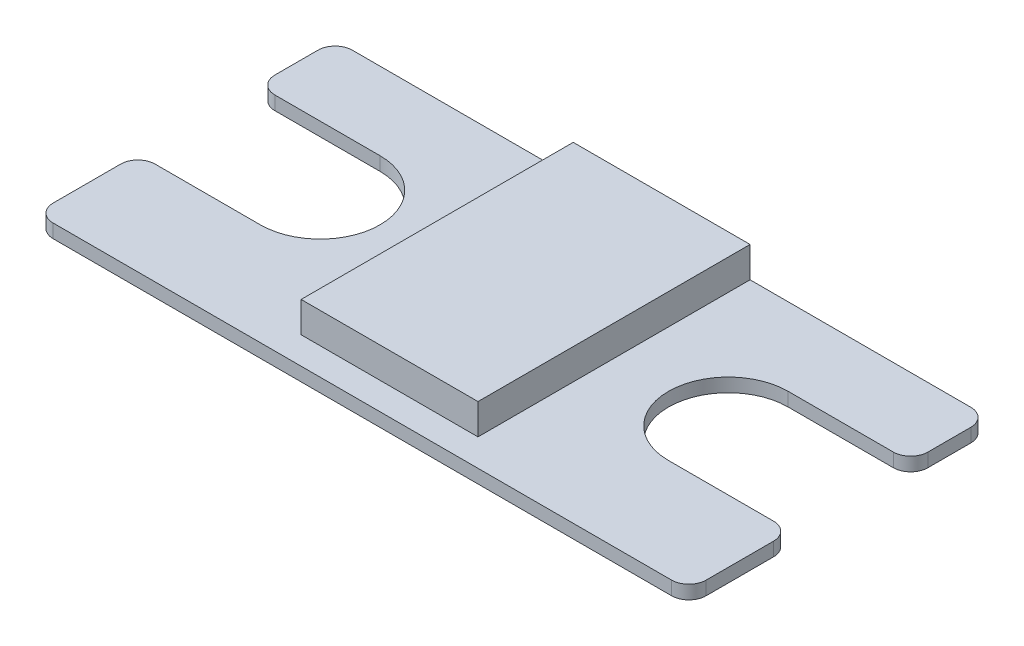
ISO-10303-21;
HEADER;
FILE_DESCRIPTION(('STEP AP214'),'2;1');
FILE_NAME('part.step','',(''),(''),'','','');
FILE_SCHEMA(('AUTOMOTIVE_DESIGN { 1 0 10303 214 1 1 1 1 }'));
ENDSEC;
DATA;
#1=APPLICATION_CONTEXT('core data for automotive mechanical design processes');
#2=APPLICATION_PROTOCOL_DEFINITION('international standard','automotive_design',2000,#1);
#3=PRODUCT_CONTEXT('',#1,'mechanical');
#4=PRODUCT('Part','Part','',(#3));
#5=PRODUCT_RELATED_PRODUCT_CATEGORY('part','',(#4));
#6=PRODUCT_DEFINITION_FORMATION('','',#4);
#7=PRODUCT_DEFINITION_CONTEXT('part definition',#1,'design');
#8=PRODUCT_DEFINITION('design','',#6,#7);
#9=PRODUCT_DEFINITION_SHAPE('','',#8);
#10=(LENGTH_UNIT() NAMED_UNIT(*) SI_UNIT(.MILLI.,.METRE.));
#11=(NAMED_UNIT(*) PLANE_ANGLE_UNIT() SI_UNIT($,.RADIAN.));
#12=(NAMED_UNIT(*) SI_UNIT($,.STERADIAN.) SOLID_ANGLE_UNIT());
#13=UNCERTAINTY_MEASURE_WITH_UNIT(LENGTH_MEASURE(1.E-05),#10,'distance_accuracy_value','');
#14=(GEOMETRIC_REPRESENTATION_CONTEXT(3) GLOBAL_UNCERTAINTY_ASSIGNED_CONTEXT((#13)) GLOBAL_UNIT_ASSIGNED_CONTEXT((#10,
#11,#12)) REPRESENTATION_CONTEXT('',''));
#15=CARTESIAN_POINT('',(0.,0.,0.));
#16=DIRECTION('',(0.,0.,1.));
#17=DIRECTION('',(1.,0.,0.));
#18=AXIS2_PLACEMENT_3D('',#15,#16,#17);
#19=CARTESIAN_POINT('',(9.,1.,-11.9));
#20=DIRECTION('',(0.,-1.,0.));
#21=DIRECTION('',(0.,0.,-1.));
#22=AXIS2_PLACEMENT_3D('',#19,#20,#21);
#23=PLANE('',#22);
#24=DIRECTION('',(0.,0.,1.));
#25=VECTOR('',#24,1.);
#26=CARTESIAN_POINT('',(17.5,1.,-22.));
#27=LINE('',#26,#25);
#28=CARTESIAN_POINT('',(17.5,1.,-22.));
#29=VERTEX_POINT('',#28);
#30=CARTESIAN_POINT('',(17.5,1.,-2.00000000000001));
#31=VERTEX_POINT('',#30);
#32=EDGE_CURVE('E53',#29,#31,#27,.T.);
#33=ORIENTED_EDGE('',*,*,#32,.F.);
#34=DIRECTION('',(-1.,0.,0.));
#35=VECTOR('',#34,1.);
#36=CARTESIAN_POINT('',(0.,1.,-22.));
#37=LINE('',#36,#35);
#38=CARTESIAN_POINT('',(1.27,1.,-22.));
#39=VERTEX_POINT('',#38);
#40=EDGE_CURVE('E239',#29,#39,#37,.T.);
#41=ORIENTED_EDGE('',*,*,#40,.T.);
#42=CARTESIAN_POINT('',(1.27,1.,-20.73));
#43=DIRECTION('',(0.,-1.,0.));
#44=DIRECTION('',(0.,0.,-1.));
#45=AXIS2_PLACEMENT_3D('',#42,#43,#44);
#46=CIRCLE('',#45,1.27);
#47=CARTESIAN_POINT('',(0.,1.,-20.73));
#48=VERTEX_POINT('',#47);
#49=EDGE_CURVE('E326',#39,#48,#46,.F.);
#50=ORIENTED_EDGE('',*,*,#49,.T.);
#51=DIRECTION('',(0.,0.,1.));
#52=VECTOR('',#51,1.);
#53=CARTESIAN_POINT('',(0.,1.,-16.3));
#54=LINE('',#53,#52);
#55=CARTESIAN_POINT('',(0.,1.,-17.57));
#56=VERTEX_POINT('',#55);
#57=EDGE_CURVE('E242',#48,#56,#54,.T.);
#58=ORIENTED_EDGE('',*,*,#57,.T.);
#59=CARTESIAN_POINT('',(1.27,1.,-17.57));
#60=DIRECTION('',(0.,-1.,0.));
#61=DIRECTION('',(0.,0.,-1.));
#62=AXIS2_PLACEMENT_3D('',#59,#60,#61);
#63=CIRCLE('',#62,1.27);
#64=CARTESIAN_POINT('',(1.27,1.,-16.3));
#65=VERTEX_POINT('',#64);
#66=EDGE_CURVE('E324',#56,#65,#63,.F.);
#67=ORIENTED_EDGE('',*,*,#66,.T.);
#68=DIRECTION('',(1.,0.,0.));
#69=VECTOR('',#68,1.);
#70=CARTESIAN_POINT('',(9.,1.,-16.3));
#71=LINE('',#70,#69);
#72=CARTESIAN_POINT('',(9.,1.,-16.3));
#73=VERTEX_POINT('',#72);
#74=EDGE_CURVE('E245',#65,#73,#71,.T.);
#75=ORIENTED_EDGE('',*,*,#74,.T.);
#76=CARTESIAN_POINT('',(9.,1.,-11.9));
#77=DIRECTION('',(0.,-1.,0.));
#78=DIRECTION('',(0.,0.,-1.));
#79=AXIS2_PLACEMENT_3D('',#76,#77,#78);
#80=CIRCLE('',#79,4.39999999999999);
#81=CARTESIAN_POINT('',(9.,1.,-7.5));
#82=VERTEX_POINT('',#81);
#83=EDGE_CURVE('E247',#73,#82,#80,.T.);
#84=ORIENTED_EDGE('',*,*,#83,.T.);
#85=DIRECTION('',(-1.,0.,0.));
#86=VECTOR('',#85,1.);
#87=CARTESIAN_POINT('',(0.,1.,-7.5));
#88=LINE('',#87,#86);
#89=CARTESIAN_POINT('',(1.27,1.,-7.5));
#90=VERTEX_POINT('',#89);
#91=EDGE_CURVE('E249',#82,#90,#88,.T.);
#92=ORIENTED_EDGE('',*,*,#91,.T.);
#93=CARTESIAN_POINT('',(1.27,1.,-6.23));
#94=DIRECTION('',(0.,-1.,0.));
#95=DIRECTION('',(0.,0.,-1.));
#96=AXIS2_PLACEMENT_3D('',#93,#94,#95);
#97=CIRCLE('',#96,1.27);
#98=CARTESIAN_POINT('',(0.,1.,-6.23));
#99=VERTEX_POINT('',#98);
#100=EDGE_CURVE('E322',#90,#99,#97,.F.);
#101=ORIENTED_EDGE('',*,*,#100,.T.);
#102=DIRECTION('',(0.,0.,1.));
#103=VECTOR('',#102,1.);
#104=CARTESIAN_POINT('',(0.,1.,0.));
#105=LINE('',#104,#103);
#106=CARTESIAN_POINT('',(0.,1.,-1.27));
#107=VERTEX_POINT('',#106);
#108=EDGE_CURVE('E252',#99,#107,#105,.T.);
#109=ORIENTED_EDGE('',*,*,#108,.T.);
#110=CARTESIAN_POINT('',(1.27,1.,-1.27));
#111=DIRECTION('',(0.,-1.,0.));
#112=DIRECTION('',(0.,0.,-1.));
#113=AXIS2_PLACEMENT_3D('',#110,#111,#112);
#114=CIRCLE('',#113,1.27);
#115=CARTESIAN_POINT('',(1.27,1.,0.));
#116=VERTEX_POINT('',#115);
#117=EDGE_CURVE('E320',#107,#116,#114,.F.);
#118=ORIENTED_EDGE('',*,*,#117,.T.);
#119=DIRECTION('',(1.,0.,0.));
#120=VECTOR('',#119,1.);
#121=CARTESIAN_POINT('',(48.,1.,0.));
#122=LINE('',#121,#120);
#123=CARTESIAN_POINT('',(46.73,1.,0.));
#124=VERTEX_POINT('',#123);
#125=EDGE_CURVE('E222',#116,#124,#122,.T.);
#126=ORIENTED_EDGE('',*,*,#125,.T.);
#127=CARTESIAN_POINT('',(46.73,1.,-1.26999999999997));
#128=DIRECTION('',(0.,-1.,0.));
#129=DIRECTION('',(0.,0.,-1.));
#130=AXIS2_PLACEMENT_3D('',#127,#128,#129);
#131=CIRCLE('',#130,1.27);
#132=CARTESIAN_POINT('',(48.,1.,-1.26999999999997));
#133=VERTEX_POINT('',#132);
#134=EDGE_CURVE('E334',#124,#133,#131,.F.);
#135=ORIENTED_EDGE('',*,*,#134,.T.);
#136=DIRECTION('',(0.,0.,-1.));
#137=VECTOR('',#136,1.);
#138=CARTESIAN_POINT('',(48.,1.,-7.5));
#139=LINE('',#138,#137);
#140=CARTESIAN_POINT('',(48.,1.,-6.23));
#141=VERTEX_POINT('',#140);
#142=EDGE_CURVE('E225',#133,#141,#139,.T.);
#143=ORIENTED_EDGE('',*,*,#142,.T.);
#144=CARTESIAN_POINT('',(46.73,1.,-6.23));
#145=DIRECTION('',(0.,-1.,0.));
#146=DIRECTION('',(0.,0.,-1.));
#147=AXIS2_PLACEMENT_3D('',#144,#145,#146);
#148=CIRCLE('',#147,1.27);
#149=CARTESIAN_POINT('',(46.73,1.,-7.5));
#150=VERTEX_POINT('',#149);
#151=EDGE_CURVE('E332',#141,#150,#148,.F.);
#152=ORIENTED_EDGE('',*,*,#151,.T.);
#153=DIRECTION('',(-1.,0.,0.));
#154=VECTOR('',#153,1.);
#155=CARTESIAN_POINT('',(39.,1.,-7.5));
#156=LINE('',#155,#154);
#157=CARTESIAN_POINT('',(39.,1.,-7.5));
#158=VERTEX_POINT('',#157);
#159=EDGE_CURVE('E229',#150,#158,#156,.T.);
#160=ORIENTED_EDGE('',*,*,#159,.T.);
#161=CARTESIAN_POINT('',(39.,1.,-11.9));
#162=DIRECTION('',(0.,-1.,0.));
#163=DIRECTION('',(0.,0.,-1.));
#164=AXIS2_PLACEMENT_3D('',#161,#162,#163);
#165=CIRCLE('',#164,4.4);
#166=CARTESIAN_POINT('',(39.,1.,-16.3));
#167=VERTEX_POINT('',#166);
#168=EDGE_CURVE('E231',#158,#167,#165,.T.);
#169=ORIENTED_EDGE('',*,*,#168,.T.);
#170=DIRECTION('',(1.,0.,0.));
#171=VECTOR('',#170,1.);
#172=CARTESIAN_POINT('',(48.,1.,-16.3));
#173=LINE('',#172,#171);
#174=CARTESIAN_POINT('',(46.73,1.,-16.3));
#175=VERTEX_POINT('',#174);
#176=EDGE_CURVE('E233',#167,#175,#173,.T.);
#177=ORIENTED_EDGE('',*,*,#176,.T.);
#178=CARTESIAN_POINT('',(46.73,1.,-17.57));
#179=DIRECTION('',(0.,-1.,0.));
#180=DIRECTION('',(0.,0.,-1.));
#181=AXIS2_PLACEMENT_3D('',#178,#179,#180);
#182=CIRCLE('',#181,1.27);
#183=CARTESIAN_POINT('',(48.,1.,-17.57));
#184=VERTEX_POINT('',#183);
#185=EDGE_CURVE('E330',#175,#184,#182,.F.);
#186=ORIENTED_EDGE('',*,*,#185,.T.);
#187=DIRECTION('',(0.,0.,-1.));
#188=VECTOR('',#187,1.);
#189=CARTESIAN_POINT('',(48.,1.,-22.));
#190=LINE('',#189,#188);
#191=CARTESIAN_POINT('',(48.,1.,-20.73));
#192=VERTEX_POINT('',#191);
#193=EDGE_CURVE('E236',#184,#192,#190,.T.);
#194=ORIENTED_EDGE('',*,*,#193,.T.);
#195=CARTESIAN_POINT('',(46.73,1.,-20.73));
#196=DIRECTION('',(0.,-1.,0.));
#197=DIRECTION('',(0.,0.,-1.));
#198=AXIS2_PLACEMENT_3D('',#195,#196,#197);
#199=CIRCLE('',#198,1.27);
#200=CARTESIAN_POINT('',(46.73,1.,-22.));
#201=VERTEX_POINT('',#200);
#202=EDGE_CURVE('E328',#192,#201,#199,.F.);
#203=ORIENTED_EDGE('',*,*,#202,.T.);
#204=CARTESIAN_POINT('',(30.5,1.,-22.));
#205=VERTEX_POINT('',#204);
#206=EDGE_CURVE('E240',#201,#205,#37,.T.);
#207=ORIENTED_EDGE('',*,*,#206,.T.);
#208=DIRECTION('',(0.,0.,-1.));
#209=VECTOR('',#208,1.);
#210=CARTESIAN_POINT('',(30.5,1.,-22.));
#211=LINE('',#210,#209);
#212=CARTESIAN_POINT('',(30.5,1.,-2.00000000000001));
#213=VERTEX_POINT('',#212);
#214=EDGE_CURVE('E210',#213,#205,#211,.T.);
#215=ORIENTED_EDGE('',*,*,#214,.F.);
#216=DIRECTION('',(1.,0.,0.));
#217=VECTOR('',#216,1.);
#218=CARTESIAN_POINT('',(17.5,1.,-2.00000000000001));
#219=LINE('',#218,#217);
#220=EDGE_CURVE('E48',#31,#213,#219,.T.);
#221=ORIENTED_EDGE('',*,*,#220,.F.);
#222=EDGE_LOOP('',(#33,#41,#50,#58,#67,#75,#84,#92,#101,#109,#118,#126,#135,#143,#152,#160,#169,
#177,#186,#194,#203,#207,#215,#221));
#223=FACE_BOUND('',#222,.T.);
#224=ADVANCED_FACE('F33',(#223),#23,.F.);
#225=CARTESIAN_POINT('',(48.,1.,0.));
#226=DIRECTION('',(0.,0.,-1.));
#227=DIRECTION('',(-1.,0.,0.));
#228=AXIS2_PLACEMENT_3D('',#225,#226,#227);
#229=PLANE('',#228);
#230=DIRECTION('',(1.,0.,0.));
#231=VECTOR('',#230,1.);
#232=CARTESIAN_POINT('',(48.,0.,0.));
#233=LINE('',#232,#231);
#234=CARTESIAN_POINT('',(1.27,0.,0.));
#235=VERTEX_POINT('',#234);
#236=CARTESIAN_POINT('',(46.73,0.,0.));
#237=VERTEX_POINT('',#236);
#238=EDGE_CURVE('E213',#235,#237,#233,.T.);
#239=ORIENTED_EDGE('',*,*,#238,.T.);
#240=DIRECTION('',(0.,-1.,0.));
#241=VECTOR('',#240,1.);
#242=CARTESIAN_POINT('',(46.73,1.,0.));
#243=LINE('',#242,#241);
#244=EDGE_CURVE('E318',#237,#124,#243,.F.);
#245=ORIENTED_EDGE('',*,*,#244,.T.);
#246=ORIENTED_EDGE('',*,*,#125,.F.);
#247=DIRECTION('',(0.,-1.,0.));
#248=VECTOR('',#247,1.);
#249=CARTESIAN_POINT('',(1.27,1.,0.));
#250=LINE('',#249,#248);
#251=EDGE_CURVE('E315',#116,#235,#250,.T.);
#252=ORIENTED_EDGE('',*,*,#251,.T.);
#253=EDGE_LOOP('',(#239,#245,#246,#252));
#254=FACE_BOUND('',#253,.T.);
#255=ADVANCED_FACE('F380',(#254),#229,.F.);
#256=CARTESIAN_POINT('',(48.,1.,-7.5));
#257=DIRECTION('',(-1.,0.,0.));
#258=DIRECTION('',(0.,0.,1.));
#259=AXIS2_PLACEMENT_3D('',#256,#257,#258);
#260=PLANE('',#259);
#261=ORIENTED_EDGE('',*,*,#142,.F.);
#262=DIRECTION('',(0.,-1.,0.));
#263=VECTOR('',#262,1.);
#264=CARTESIAN_POINT('',(48.,1.,-1.26999999999997));
#265=LINE('',#264,#263);
#266=CARTESIAN_POINT('',(48.,0.,-1.26999999999997));
#267=VERTEX_POINT('',#266);
#268=EDGE_CURVE('E296',#133,#267,#265,.T.);
#269=ORIENTED_EDGE('',*,*,#268,.T.);
#270=DIRECTION('',(0.,0.,-1.));
#271=VECTOR('',#270,1.);
#272=CARTESIAN_POINT('',(48.,0.,-7.5));
#273=LINE('',#272,#271);
#274=CARTESIAN_POINT('',(48.,0.,-6.23));
#275=VERTEX_POINT('',#274);
#276=EDGE_CURVE('E216',#267,#275,#273,.T.);
#277=ORIENTED_EDGE('',*,*,#276,.T.);
#278=DIRECTION('',(0.,-1.,0.));
#279=VECTOR('',#278,1.);
#280=CARTESIAN_POINT('',(48.,1.,-6.23));
#281=LINE('',#280,#279);
#282=EDGE_CURVE('E294',#275,#141,#281,.F.);
#283=ORIENTED_EDGE('',*,*,#282,.T.);
#284=EDGE_LOOP('',(#261,#269,#277,#283));
#285=FACE_BOUND('',#284,.T.);
#286=ADVANCED_FACE('F388',(#285),#260,.F.);
#287=CARTESIAN_POINT('',(39.,1.,-7.5));
#288=DIRECTION('',(0.,0.,1.));
#289=DIRECTION('',(1.,0.,0.));
#290=AXIS2_PLACEMENT_3D('',#287,#288,#289);
#291=PLANE('',#290);
#292=ORIENTED_EDGE('',*,*,#159,.F.);
#293=DIRECTION('',(0.,-1.,0.));
#294=VECTOR('',#293,1.);
#295=CARTESIAN_POINT('',(46.73,1.,-7.5));
#296=LINE('',#295,#294);
#297=CARTESIAN_POINT('',(46.73,0.,-7.5));
#298=VERTEX_POINT('',#297);
#299=EDGE_CURVE('E336',#150,#298,#296,.T.);
#300=ORIENTED_EDGE('',*,*,#299,.T.);
#301=DIRECTION('',(-1.,0.,0.));
#302=VECTOR('',#301,1.);
#303=CARTESIAN_POINT('',(39.,0.,-7.5));
#304=LINE('',#303,#302);
#305=CARTESIAN_POINT('',(39.,0.,-7.5));
#306=VERTEX_POINT('',#305);
#307=EDGE_CURVE('E258',#298,#306,#304,.T.);
#308=ORIENTED_EDGE('',*,*,#307,.T.);
#309=DIRECTION('',(0.,-1.,0.));
#310=VECTOR('',#309,1.);
#311=CARTESIAN_POINT('',(39.,1.,-7.5));
#312=LINE('',#311,#310);
#313=EDGE_CURVE('E291',#158,#306,#312,.T.);
#314=ORIENTED_EDGE('',*,*,#313,.F.);
#315=EDGE_LOOP('',(#292,#300,#308,#314));
#316=FACE_BOUND('',#315,.T.);
#317=ADVANCED_FACE('F398',(#316),#291,.F.);
#318=CARTESIAN_POINT('',(39.,1.,-11.9));
#319=DIRECTION('',(0.,-1.,0.));
#320=DIRECTION('',(0.,0.,-1.));
#321=AXIS2_PLACEMENT_3D('',#318,#319,#320);
#322=CYLINDRICAL_SURFACE('',#321,4.4);
#323=CARTESIAN_POINT('',(39.,0.,-11.9));
#324=DIRECTION('',(0.,-1.,0.));
#325=DIRECTION('',(0.,0.,-1.));
#326=AXIS2_PLACEMENT_3D('',#323,#324,#325);
#327=CIRCLE('',#326,4.4);
#328=CARTESIAN_POINT('',(39.,0.,-16.3));
#329=VERTEX_POINT('',#328);
#330=EDGE_CURVE('E260',#306,#329,#327,.T.);
#331=ORIENTED_EDGE('',*,*,#330,.T.);
#332=DIRECTION('',(0.,-1.,0.));
#333=VECTOR('',#332,1.);
#334=CARTESIAN_POINT('',(39.,1.,-16.3));
#335=LINE('',#334,#333);
#336=EDGE_CURVE('E288',#167,#329,#335,.T.);
#337=ORIENTED_EDGE('',*,*,#336,.F.);
#338=ORIENTED_EDGE('',*,*,#168,.F.);
#339=ORIENTED_EDGE('',*,*,#313,.T.);
#340=EDGE_LOOP('',(#331,#337,#338,#339));
#341=FACE_BOUND('',#340,.T.);
#342=ADVANCED_FACE('F405',(#341),#322,.F.);
#343=CARTESIAN_POINT('',(48.,1.,-16.3));
#344=DIRECTION('',(0.,0.,-1.));
#345=DIRECTION('',(-1.,0.,0.));
#346=AXIS2_PLACEMENT_3D('',#343,#344,#345);
#347=PLANE('',#346);
#348=DIRECTION('',(1.,0.,0.));
#349=VECTOR('',#348,1.);
#350=CARTESIAN_POINT('',(48.,0.,-16.3));
#351=LINE('',#350,#349);
#352=CARTESIAN_POINT('',(46.73,0.,-16.3));
#353=VERTEX_POINT('',#352);
#354=EDGE_CURVE('E262',#329,#353,#351,.T.);
#355=ORIENTED_EDGE('',*,*,#354,.T.);
#356=DIRECTION('',(0.,-1.,0.));
#357=VECTOR('',#356,1.);
#358=CARTESIAN_POINT('',(46.73,1.,-16.3));
#359=LINE('',#358,#357);
#360=EDGE_CURVE('E344',#353,#175,#359,.F.);
#361=ORIENTED_EDGE('',*,*,#360,.T.);
#362=ORIENTED_EDGE('',*,*,#176,.F.);
#363=ORIENTED_EDGE('',*,*,#336,.T.);
#364=EDGE_LOOP('',(#355,#361,#362,#363));
#365=FACE_BOUND('',#364,.T.);
#366=ADVANCED_FACE('F408',(#365),#347,.F.);
#367=CARTESIAN_POINT('',(48.,1.,-22.));
#368=DIRECTION('',(-1.,0.,0.));
#369=DIRECTION('',(0.,0.,1.));
#370=AXIS2_PLACEMENT_3D('',#367,#368,#369);
#371=PLANE('',#370);
#372=ORIENTED_EDGE('',*,*,#193,.F.);
#373=DIRECTION('',(0.,-1.,0.));
#374=VECTOR('',#373,1.);
#375=CARTESIAN_POINT('',(48.,1.,-17.57));
#376=LINE('',#375,#374);
#377=CARTESIAN_POINT('',(48.,0.,-17.57));
#378=VERTEX_POINT('',#377);
#379=EDGE_CURVE('E341',#184,#378,#376,.T.);
#380=ORIENTED_EDGE('',*,*,#379,.T.);
#381=DIRECTION('',(0.,0.,-1.));
#382=VECTOR('',#381,1.);
#383=CARTESIAN_POINT('',(48.,0.,-22.));
#384=LINE('',#383,#382);
#385=CARTESIAN_POINT('',(48.,0.,-20.73));
#386=VERTEX_POINT('',#385);
#387=EDGE_CURVE('E265',#378,#386,#384,.T.);
#388=ORIENTED_EDGE('',*,*,#387,.T.);
#389=DIRECTION('',(0.,-1.,0.));
#390=VECTOR('',#389,1.);
#391=CARTESIAN_POINT('',(48.,1.,-20.73));
#392=LINE('',#391,#390);
#393=EDGE_CURVE('E339',#386,#192,#392,.F.);
#394=ORIENTED_EDGE('',*,*,#393,.T.);
#395=EDGE_LOOP('',(#372,#380,#388,#394));
#396=FACE_BOUND('',#395,.T.);
#397=ADVANCED_FACE('F416',(#396),#371,.F.);
#398=CARTESIAN_POINT('',(0.,1.,-22.));
#399=DIRECTION('',(0.,0.,1.));
#400=DIRECTION('',(1.,0.,0.));
#401=AXIS2_PLACEMENT_3D('',#398,#399,#400);
#402=PLANE('',#401);
#403=ORIENTED_EDGE('',*,*,#206,.F.);
#404=DIRECTION('',(0.,-1.,0.));
#405=VECTOR('',#404,1.);
#406=CARTESIAN_POINT('',(46.73,1.,-22.));
#407=LINE('',#406,#405);
#408=CARTESIAN_POINT('',(46.73,0.,-22.));
#409=VERTEX_POINT('',#408);
#410=EDGE_CURVE('E349',#201,#409,#407,.T.);
#411=ORIENTED_EDGE('',*,*,#410,.T.);
#412=DIRECTION('',(-1.,0.,0.));
#413=VECTOR('',#412,1.);
#414=CARTESIAN_POINT('',(0.,0.,-22.));
#415=LINE('',#414,#413);
#416=CARTESIAN_POINT('',(1.27,0.,-22.));
#417=VERTEX_POINT('',#416);
#418=EDGE_CURVE('E268',#409,#417,#415,.T.);
#419=ORIENTED_EDGE('',*,*,#418,.T.);
#420=DIRECTION('',(0.,-1.,0.));
#421=VECTOR('',#420,1.);
#422=CARTESIAN_POINT('',(1.27,1.,-22.));
#423=LINE('',#422,#421);
#424=EDGE_CURVE('E346',#417,#39,#423,.F.);
#425=ORIENTED_EDGE('',*,*,#424,.T.);
#426=ORIENTED_EDGE('',*,*,#40,.F.);
#427=DIRECTION('',(0.,-1.,0.));
#428=VECTOR('',#427,1.);
#429=CARTESIAN_POINT('',(17.5,3.25,-22.));
#430=LINE('',#429,#428);
#431=CARTESIAN_POINT('',(17.5,3.25,-22.));
#432=VERTEX_POINT('',#431);
#433=EDGE_CURVE('E430',#432,#29,#430,.T.);
#434=ORIENTED_EDGE('',*,*,#433,.F.);
#435=DIRECTION('',(-1.,0.,0.));
#436=VECTOR('',#435,1.);
#437=CARTESIAN_POINT('',(17.5,3.25,-22.));
#438=LINE('',#437,#436);
#439=CARTESIAN_POINT('',(30.5,3.25,-22.));
#440=VERTEX_POINT('',#439);
#441=EDGE_CURVE('E206',#440,#432,#438,.T.);
#442=ORIENTED_EDGE('',*,*,#441,.F.);
#443=DIRECTION('',(0.,-1.,0.));
#444=VECTOR('',#443,1.);
#445=CARTESIAN_POINT('',(30.5,3.25,-22.));
#446=LINE('',#445,#444);
#447=EDGE_CURVE('E218',#440,#205,#446,.T.);
#448=ORIENTED_EDGE('',*,*,#447,.T.);
#449=EDGE_LOOP('',(#403,#411,#419,#425,#426,#434,#442,#448));
#450=FACE_BOUND('',#449,.T.);
#451=ADVANCED_FACE('F426',(#450),#402,.F.);
#452=CARTESIAN_POINT('',(0.,1.,-16.3));
#453=DIRECTION('',(1.,0.,0.));
#454=DIRECTION('',(0.,0.,-1.));
#455=AXIS2_PLACEMENT_3D('',#452,#453,#454);
#456=PLANE('',#455);
#457=ORIENTED_EDGE('',*,*,#57,.F.);
#458=DIRECTION('',(0.,-1.,0.));
#459=VECTOR('',#458,1.);
#460=CARTESIAN_POINT('',(0.,1.,-20.73));
#461=LINE('',#460,#459);
#462=CARTESIAN_POINT('',(0.,0.,-20.73));
#463=VERTEX_POINT('',#462);
#464=EDGE_CURVE('E354',#48,#463,#461,.T.);
#465=ORIENTED_EDGE('',*,*,#464,.T.);
#466=DIRECTION('',(0.,0.,1.));
#467=VECTOR('',#466,1.);
#468=CARTESIAN_POINT('',(0.,0.,-16.3));
#469=LINE('',#468,#467);
#470=CARTESIAN_POINT('',(0.,0.,-17.57));
#471=VERTEX_POINT('',#470);
#472=EDGE_CURVE('E271',#463,#471,#469,.T.);
#473=ORIENTED_EDGE('',*,*,#472,.T.);
#474=DIRECTION('',(0.,-1.,0.));
#475=VECTOR('',#474,1.);
#476=CARTESIAN_POINT('',(0.,1.,-17.57));
#477=LINE('',#476,#475);
#478=EDGE_CURVE('E352',#471,#56,#477,.F.);
#479=ORIENTED_EDGE('',*,*,#478,.T.);
#480=EDGE_LOOP('',(#457,#465,#473,#479));
#481=FACE_BOUND('',#480,.T.);
#482=ADVANCED_FACE('F469',(#481),#456,.F.);
#483=CARTESIAN_POINT('',(9.,1.,-16.3));
#484=DIRECTION('',(0.,0.,-1.));
#485=DIRECTION('',(-1.,0.,0.));
#486=AXIS2_PLACEMENT_3D('',#483,#484,#485);
#487=PLANE('',#486);
#488=ORIENTED_EDGE('',*,*,#74,.F.);
#489=DIRECTION('',(0.,-1.,0.));
#490=VECTOR('',#489,1.);
#491=CARTESIAN_POINT('',(1.27,1.,-16.3));
#492=LINE('',#491,#490);
#493=CARTESIAN_POINT('',(1.27,0.,-16.3));
#494=VERTEX_POINT('',#493);
#495=EDGE_CURVE('E357',#65,#494,#492,.T.);
#496=ORIENTED_EDGE('',*,*,#495,.T.);
#497=DIRECTION('',(1.,0.,0.));
#498=VECTOR('',#497,1.);
#499=CARTESIAN_POINT('',(9.,0.,-16.3));
#500=LINE('',#499,#498);
#501=CARTESIAN_POINT('',(9.,0.,-16.3));
#502=VERTEX_POINT('',#501);
#503=EDGE_CURVE('E274',#494,#502,#500,.T.);
#504=ORIENTED_EDGE('',*,*,#503,.T.);
#505=DIRECTION('',(0.,-1.,0.));
#506=VECTOR('',#505,1.);
#507=CARTESIAN_POINT('',(9.,1.,-16.3));
#508=LINE('',#507,#506);
#509=EDGE_CURVE('E285',#73,#502,#508,.T.);
#510=ORIENTED_EDGE('',*,*,#509,.F.);
#511=EDGE_LOOP('',(#488,#496,#504,#510));
#512=FACE_BOUND('',#511,.T.);
#513=ADVANCED_FACE('F465',(#512),#487,.F.);
#514=CARTESIAN_POINT('',(9.,1.,-11.9));
#515=DIRECTION('',(0.,-1.,0.));
#516=DIRECTION('',(0.,0.,-1.));
#517=AXIS2_PLACEMENT_3D('',#514,#515,#516);
#518=CYLINDRICAL_SURFACE('',#517,4.39999999999999);
#519=CARTESIAN_POINT('',(9.,0.,-11.9));
#520=DIRECTION('',(0.,-1.,0.));
#521=DIRECTION('',(0.,0.,-1.));
#522=AXIS2_PLACEMENT_3D('',#519,#520,#521);
#523=CIRCLE('',#522,4.39999999999999);
#524=CARTESIAN_POINT('',(9.,0.,-7.5));
#525=VERTEX_POINT('',#524);
#526=EDGE_CURVE('E276',#502,#525,#523,.T.);
#527=ORIENTED_EDGE('',*,*,#526,.T.);
#528=DIRECTION('',(0.,-1.,0.));
#529=VECTOR('',#528,1.);
#530=CARTESIAN_POINT('',(9.,1.,-7.5));
#531=LINE('',#530,#529);
#532=EDGE_CURVE('E254',#82,#525,#531,.T.);
#533=ORIENTED_EDGE('',*,*,#532,.F.);
#534=ORIENTED_EDGE('',*,*,#83,.F.);
#535=ORIENTED_EDGE('',*,*,#509,.T.);
#536=EDGE_LOOP('',(#527,#533,#534,#535));
#537=FACE_BOUND('',#536,.T.);
#538=ADVANCED_FACE('F461',(#537),#518,.F.);
#539=CARTESIAN_POINT('',(0.,1.,-7.5));
#540=DIRECTION('',(0.,0.,1.));
#541=DIRECTION('',(1.,0.,0.));
#542=AXIS2_PLACEMENT_3D('',#539,#540,#541);
#543=PLANE('',#542);
#544=DIRECTION('',(-1.,0.,0.));
#545=VECTOR('',#544,1.);
#546=CARTESIAN_POINT('',(0.,0.,-7.5));
#547=LINE('',#546,#545);
#548=CARTESIAN_POINT('',(1.27,0.,-7.5));
#549=VERTEX_POINT('',#548);
#550=EDGE_CURVE('E278',#525,#549,#547,.T.);
#551=ORIENTED_EDGE('',*,*,#550,.T.);
#552=DIRECTION('',(0.,-1.,0.));
#553=VECTOR('',#552,1.);
#554=CARTESIAN_POINT('',(1.27,1.,-7.5));
#555=LINE('',#554,#553);
#556=EDGE_CURVE('E11',#549,#90,#555,.F.);
#557=ORIENTED_EDGE('',*,*,#556,.T.);
#558=ORIENTED_EDGE('',*,*,#91,.F.);
#559=ORIENTED_EDGE('',*,*,#532,.T.);
#560=EDGE_LOOP('',(#551,#557,#558,#559));
#561=FACE_BOUND('',#560,.T.);
#562=ADVANCED_FACE('F458',(#561),#543,.F.);
#563=CARTESIAN_POINT('',(0.,1.,0.));
#564=DIRECTION('',(1.,0.,0.));
#565=DIRECTION('',(0.,0.,-1.));
#566=AXIS2_PLACEMENT_3D('',#563,#564,#565);
#567=PLANE('',#566);
#568=ORIENTED_EDGE('',*,*,#108,.F.);
#569=DIRECTION('',(0.,-1.,0.));
#570=VECTOR('',#569,1.);
#571=CARTESIAN_POINT('',(0.,1.,-6.23));
#572=LINE('',#571,#570);
#573=CARTESIAN_POINT('',(0.,0.,-6.23));
#574=VERTEX_POINT('',#573);
#575=EDGE_CURVE('E41',#99,#574,#572,.T.);
#576=ORIENTED_EDGE('',*,*,#575,.T.);
#577=DIRECTION('',(0.,0.,1.));
#578=VECTOR('',#577,1.);
#579=CARTESIAN_POINT('',(0.,0.,0.));
#580=LINE('',#579,#578);
#581=CARTESIAN_POINT('',(0.,0.,-1.27));
#582=VERTEX_POINT('',#581);
#583=EDGE_CURVE('E226',#574,#582,#580,.T.);
#584=ORIENTED_EDGE('',*,*,#583,.T.);
#585=DIRECTION('',(0.,-1.,0.));
#586=VECTOR('',#585,1.);
#587=CARTESIAN_POINT('',(0.,1.,-1.27));
#588=LINE('',#587,#586);
#589=EDGE_CURVE('E360',#582,#107,#588,.F.);
#590=ORIENTED_EDGE('',*,*,#589,.T.);
#591=EDGE_LOOP('',(#568,#576,#584,#590));
#592=FACE_BOUND('',#591,.T.);
#593=ADVANCED_FACE('F366',(#592),#567,.F.);
#594=CARTESIAN_POINT('',(9.,0.,-11.9));
#595=DIRECTION('',(0.,-1.,0.));
#596=DIRECTION('',(0.,0.,-1.));
#597=AXIS2_PLACEMENT_3D('',#594,#595,#596);
#598=PLANE('',#597);
#599=ORIENTED_EDGE('',*,*,#276,.F.);
#600=CARTESIAN_POINT('',(46.73,0.,-1.26999999999997));
#601=DIRECTION('',(0.,-1.,0.));
#602=DIRECTION('',(0.,0.,-1.));
#603=AXIS2_PLACEMENT_3D('',#600,#601,#602);
#604=CIRCLE('',#603,1.27);
#605=EDGE_CURVE('E313',#267,#237,#604,.T.);
#606=ORIENTED_EDGE('',*,*,#605,.T.);
#607=ORIENTED_EDGE('',*,*,#238,.F.);
#608=CARTESIAN_POINT('',(1.27,0.,-1.27));
#609=DIRECTION('',(0.,-1.,0.));
#610=DIRECTION('',(0.,0.,-1.));
#611=AXIS2_PLACEMENT_3D('',#608,#609,#610);
#612=CIRCLE('',#611,1.27);
#613=EDGE_CURVE('E299',#235,#582,#612,.T.);
#614=ORIENTED_EDGE('',*,*,#613,.T.);
#615=ORIENTED_EDGE('',*,*,#583,.F.);
#616=CARTESIAN_POINT('',(1.27,0.,-6.23));
#617=DIRECTION('',(0.,-1.,0.));
#618=DIRECTION('',(0.,0.,-1.));
#619=AXIS2_PLACEMENT_3D('',#616,#617,#618);
#620=CIRCLE('',#619,1.27);
#621=EDGE_CURVE('E301',#574,#549,#620,.T.);
#622=ORIENTED_EDGE('',*,*,#621,.T.);
#623=ORIENTED_EDGE('',*,*,#550,.F.);
#624=ORIENTED_EDGE('',*,*,#526,.F.);
#625=ORIENTED_EDGE('',*,*,#503,.F.);
#626=CARTESIAN_POINT('',(1.27,0.,-17.57));
#627=DIRECTION('',(0.,-1.,0.));
#628=DIRECTION('',(0.,0.,-1.));
#629=AXIS2_PLACEMENT_3D('',#626,#627,#628);
#630=CIRCLE('',#629,1.27);
#631=EDGE_CURVE('E303',#494,#471,#630,.T.);
#632=ORIENTED_EDGE('',*,*,#631,.T.);
#633=ORIENTED_EDGE('',*,*,#472,.F.);
#634=CARTESIAN_POINT('',(1.27,0.,-20.73));
#635=DIRECTION('',(0.,-1.,0.));
#636=DIRECTION('',(0.,0.,-1.));
#637=AXIS2_PLACEMENT_3D('',#634,#635,#636);
#638=CIRCLE('',#637,1.27);
#639=EDGE_CURVE('E305',#463,#417,#638,.T.);
#640=ORIENTED_EDGE('',*,*,#639,.T.);
#641=ORIENTED_EDGE('',*,*,#418,.F.);
#642=CARTESIAN_POINT('',(46.73,0.,-20.73));
#643=DIRECTION('',(0.,-1.,0.));
#644=DIRECTION('',(0.,0.,-1.));
#645=AXIS2_PLACEMENT_3D('',#642,#643,#644);
#646=CIRCLE('',#645,1.27);
#647=EDGE_CURVE('E307',#409,#386,#646,.T.);
#648=ORIENTED_EDGE('',*,*,#647,.T.);
#649=ORIENTED_EDGE('',*,*,#387,.F.);
#650=CARTESIAN_POINT('',(46.73,0.,-17.57));
#651=DIRECTION('',(0.,-1.,0.));
#652=DIRECTION('',(0.,0.,-1.));
#653=AXIS2_PLACEMENT_3D('',#650,#651,#652);
#654=CIRCLE('',#653,1.27);
#655=EDGE_CURVE('E309',#378,#353,#654,.T.);
#656=ORIENTED_EDGE('',*,*,#655,.T.);
#657=ORIENTED_EDGE('',*,*,#354,.F.);
#658=ORIENTED_EDGE('',*,*,#330,.F.);
#659=ORIENTED_EDGE('',*,*,#307,.F.);
#660=CARTESIAN_POINT('',(46.73,0.,-6.23));
#661=DIRECTION('',(0.,-1.,0.));
#662=DIRECTION('',(0.,0.,-1.));
#663=AXIS2_PLACEMENT_3D('',#660,#661,#662);
#664=CIRCLE('',#663,1.27);
#665=EDGE_CURVE('E311',#298,#275,#664,.T.);
#666=ORIENTED_EDGE('',*,*,#665,.T.);
#667=EDGE_LOOP('',(#599,#606,#607,#614,#615,#622,#623,#624,#625,#632,#633,#640,#641,#648,#649,
#656,#657,#658,#659,#666));
#668=FACE_BOUND('',#667,.T.);
#669=ADVANCED_FACE('F372',(#668),#598,.T.);
#670=CARTESIAN_POINT('',(46.73,1.,-1.26999999999997));
#671=DIRECTION('',(0.,-1.,0.));
#672=DIRECTION('',(0.,0.,-1.));
#673=AXIS2_PLACEMENT_3D('',#670,#671,#672);
#674=CYLINDRICAL_SURFACE('',#673,1.27);
#675=ORIENTED_EDGE('',*,*,#134,.F.);
#676=ORIENTED_EDGE('',*,*,#244,.F.);
#677=ORIENTED_EDGE('',*,*,#605,.F.);
#678=ORIENTED_EDGE('',*,*,#268,.F.);
#679=EDGE_LOOP('',(#675,#676,#677,#678));
#680=FACE_BOUND('',#679,.T.);
#681=ADVANCED_FACE('F386',(#680),#674,.T.);
#682=CARTESIAN_POINT('',(46.73,1.,-6.23));
#683=DIRECTION('',(0.,-1.,0.));
#684=DIRECTION('',(0.,0.,-1.));
#685=AXIS2_PLACEMENT_3D('',#682,#683,#684);
#686=CYLINDRICAL_SURFACE('',#685,1.27);
#687=ORIENTED_EDGE('',*,*,#151,.F.);
#688=ORIENTED_EDGE('',*,*,#282,.F.);
#689=ORIENTED_EDGE('',*,*,#665,.F.);
#690=ORIENTED_EDGE('',*,*,#299,.F.);
#691=EDGE_LOOP('',(#687,#688,#689,#690));
#692=FACE_BOUND('',#691,.T.);
#693=ADVANCED_FACE('F395',(#692),#686,.T.);
#694=CARTESIAN_POINT('',(46.73,1.,-17.57));
#695=DIRECTION('',(0.,-1.,0.));
#696=DIRECTION('',(0.,0.,-1.));
#697=AXIS2_PLACEMENT_3D('',#694,#695,#696);
#698=CYLINDRICAL_SURFACE('',#697,1.27);
#699=ORIENTED_EDGE('',*,*,#185,.F.);
#700=ORIENTED_EDGE('',*,*,#360,.F.);
#701=ORIENTED_EDGE('',*,*,#655,.F.);
#702=ORIENTED_EDGE('',*,*,#379,.F.);
#703=EDGE_LOOP('',(#699,#700,#701,#702));
#704=FACE_BOUND('',#703,.T.);
#705=ADVANCED_FACE('F411',(#704),#698,.T.);
#706=CARTESIAN_POINT('',(46.73,1.,-20.73));
#707=DIRECTION('',(0.,-1.,0.));
#708=DIRECTION('',(0.,0.,-1.));
#709=AXIS2_PLACEMENT_3D('',#706,#707,#708);
#710=CYLINDRICAL_SURFACE('',#709,1.27);
#711=ORIENTED_EDGE('',*,*,#202,.F.);
#712=ORIENTED_EDGE('',*,*,#393,.F.);
#713=ORIENTED_EDGE('',*,*,#647,.F.);
#714=ORIENTED_EDGE('',*,*,#410,.F.);
#715=EDGE_LOOP('',(#711,#712,#713,#714));
#716=FACE_BOUND('',#715,.T.);
#717=ADVANCED_FACE('F420',(#716),#710,.T.);
#718=CARTESIAN_POINT('',(1.27,1.,-20.73));
#719=DIRECTION('',(0.,-1.,0.));
#720=DIRECTION('',(0.,0.,-1.));
#721=AXIS2_PLACEMENT_3D('',#718,#719,#720);
#722=CYLINDRICAL_SURFACE('',#721,1.27);
#723=ORIENTED_EDGE('',*,*,#49,.F.);
#724=ORIENTED_EDGE('',*,*,#424,.F.);
#725=ORIENTED_EDGE('',*,*,#639,.F.);
#726=ORIENTED_EDGE('',*,*,#464,.F.);
#727=EDGE_LOOP('',(#723,#724,#725,#726));
#728=FACE_BOUND('',#727,.T.);
#729=ADVANCED_FACE('F494',(#728),#722,.T.);
#730=CARTESIAN_POINT('',(1.27,1.,-17.57));
#731=DIRECTION('',(0.,-1.,0.));
#732=DIRECTION('',(0.,0.,-1.));
#733=AXIS2_PLACEMENT_3D('',#730,#731,#732);
#734=CYLINDRICAL_SURFACE('',#733,1.27);
#735=ORIENTED_EDGE('',*,*,#66,.F.);
#736=ORIENTED_EDGE('',*,*,#478,.F.);
#737=ORIENTED_EDGE('',*,*,#631,.F.);
#738=ORIENTED_EDGE('',*,*,#495,.F.);
#739=EDGE_LOOP('',(#735,#736,#737,#738));
#740=FACE_BOUND('',#739,.T.);
#741=ADVANCED_FACE('F497',(#740),#734,.T.);
#742=CARTESIAN_POINT('',(1.27,1.,-6.23));
#743=DIRECTION('',(0.,-1.,0.));
#744=DIRECTION('',(0.,0.,-1.));
#745=AXIS2_PLACEMENT_3D('',#742,#743,#744);
#746=CYLINDRICAL_SURFACE('',#745,1.27);
#747=ORIENTED_EDGE('',*,*,#100,.F.);
#748=ORIENTED_EDGE('',*,*,#556,.F.);
#749=ORIENTED_EDGE('',*,*,#621,.F.);
#750=ORIENTED_EDGE('',*,*,#575,.F.);
#751=EDGE_LOOP('',(#747,#748,#749,#750));
#752=FACE_BOUND('',#751,.T.);
#753=ADVANCED_FACE('F500',(#752),#746,.T.);
#754=CARTESIAN_POINT('',(1.27,1.,-1.27));
#755=DIRECTION('',(0.,-1.,0.));
#756=DIRECTION('',(0.,0.,-1.));
#757=AXIS2_PLACEMENT_3D('',#754,#755,#756);
#758=CYLINDRICAL_SURFACE('',#757,1.27);
#759=ORIENTED_EDGE('',*,*,#117,.F.);
#760=ORIENTED_EDGE('',*,*,#589,.F.);
#761=ORIENTED_EDGE('',*,*,#613,.F.);
#762=ORIENTED_EDGE('',*,*,#251,.F.);
#763=EDGE_LOOP('',(#759,#760,#761,#762));
#764=FACE_BOUND('',#763,.T.);
#765=ADVANCED_FACE('F35',(#764),#758,.T.);
#766=CARTESIAN_POINT('',(17.5,3.25,-22.));
#767=DIRECTION('',(1.,0.,0.));
#768=DIRECTION('',(0.,0.,-1.));
#769=AXIS2_PLACEMENT_3D('',#766,#767,#768);
#770=PLANE('',#769);
#771=ORIENTED_EDGE('',*,*,#32,.T.);
#772=DIRECTION('',(0.,-1.,0.));
#773=VECTOR('',#772,1.);
#774=CARTESIAN_POINT('',(17.5,3.25,-2.00000000000001));
#775=LINE('',#774,#773);
#776=CARTESIAN_POINT('',(17.5,3.25,-2.00000000000001));
#777=VERTEX_POINT('',#776);
#778=EDGE_CURVE('E195',#777,#31,#775,.T.);
#779=ORIENTED_EDGE('',*,*,#778,.F.);
#780=DIRECTION('',(0.,0.,1.));
#781=VECTOR('',#780,1.);
#782=CARTESIAN_POINT('',(17.5,3.25,-22.));
#783=LINE('',#782,#781);
#784=EDGE_CURVE('E201',#432,#777,#783,.T.);
#785=ORIENTED_EDGE('',*,*,#784,.F.);
#786=ORIENTED_EDGE('',*,*,#433,.T.);
#787=EDGE_LOOP('',(#771,#779,#785,#786));
#788=FACE_BOUND('',#787,.T.);
#789=ADVANCED_FACE('F212',(#788),#770,.F.);
#790=CARTESIAN_POINT('',(17.5,3.25,-2.00000000000001));
#791=DIRECTION('',(0.,0.,-1.));
#792=DIRECTION('',(-1.,0.,0.));
#793=AXIS2_PLACEMENT_3D('',#790,#791,#792);
#794=PLANE('',#793);
#795=ORIENTED_EDGE('',*,*,#220,.T.);
#796=DIRECTION('',(0.,-1.,0.));
#797=VECTOR('',#796,1.);
#798=CARTESIAN_POINT('',(30.5,3.25,-2.00000000000001));
#799=LINE('',#798,#797);
#800=CARTESIAN_POINT('',(30.5,3.25,-2.00000000000001));
#801=VERTEX_POINT('',#800);
#802=EDGE_CURVE('E197',#801,#213,#799,.T.);
#803=ORIENTED_EDGE('',*,*,#802,.F.);
#804=DIRECTION('',(1.,0.,0.));
#805=VECTOR('',#804,1.);
#806=CARTESIAN_POINT('',(17.5,3.25,-2.00000000000001));
#807=LINE('',#806,#805);
#808=EDGE_CURVE('E191',#777,#801,#807,.T.);
#809=ORIENTED_EDGE('',*,*,#808,.F.);
#810=ORIENTED_EDGE('',*,*,#778,.T.);
#811=EDGE_LOOP('',(#795,#803,#809,#810));
#812=FACE_BOUND('',#811,.T.);
#813=ADVANCED_FACE('F193',(#812),#794,.F.);
#814=CARTESIAN_POINT('',(30.5,3.25,-22.));
#815=DIRECTION('',(-1.,0.,0.));
#816=DIRECTION('',(0.,0.,1.));
#817=AXIS2_PLACEMENT_3D('',#814,#815,#816);
#818=PLANE('',#817);
#819=ORIENTED_EDGE('',*,*,#214,.T.);
#820=ORIENTED_EDGE('',*,*,#447,.F.);
#821=DIRECTION('',(0.,0.,-1.));
#822=VECTOR('',#821,1.);
#823=CARTESIAN_POINT('',(30.5,3.25,-22.));
#824=LINE('',#823,#822);
#825=EDGE_CURVE('E200',#801,#440,#824,.T.);
#826=ORIENTED_EDGE('',*,*,#825,.F.);
#827=ORIENTED_EDGE('',*,*,#802,.T.);
#828=EDGE_LOOP('',(#819,#820,#826,#827));
#829=FACE_BOUND('',#828,.T.);
#830=ADVANCED_FACE('F437',(#829),#818,.F.);
#831=CARTESIAN_POINT('',(0.,3.25,0.));
#832=DIRECTION('',(0.,1.,0.));
#833=DIRECTION('',(0.,0.,1.));
#834=AXIS2_PLACEMENT_3D('',#831,#832,#833);
#835=PLANE('',#834);
#836=ORIENTED_EDGE('',*,*,#784,.T.);
#837=ORIENTED_EDGE('',*,*,#808,.T.);
#838=ORIENTED_EDGE('',*,*,#825,.T.);
#839=ORIENTED_EDGE('',*,*,#441,.T.);
#840=EDGE_LOOP('',(#836,#837,#838,#839));
#841=FACE_BOUND('',#840,.T.);
#842=ADVANCED_FACE('F204',(#841),#835,.T.);
#843=CLOSED_SHELL('',(#224,#255,#286,#317,#342,#366,#397,#451,#482,#513,#538,#562,#593,#669,
#681,#693,#705,#717,#729,#741,#753,#765,#789,#813,#830,#842));
#844=MANIFOLD_SOLID_BREP('B2',#843);
#845=ADVANCED_BREP_SHAPE_REPRESENTATION('',(#18,#844),#14);
#846=SHAPE_DEFINITION_REPRESENTATION(#9,#845);
ENDSEC;
END-ISO-10303-21;
